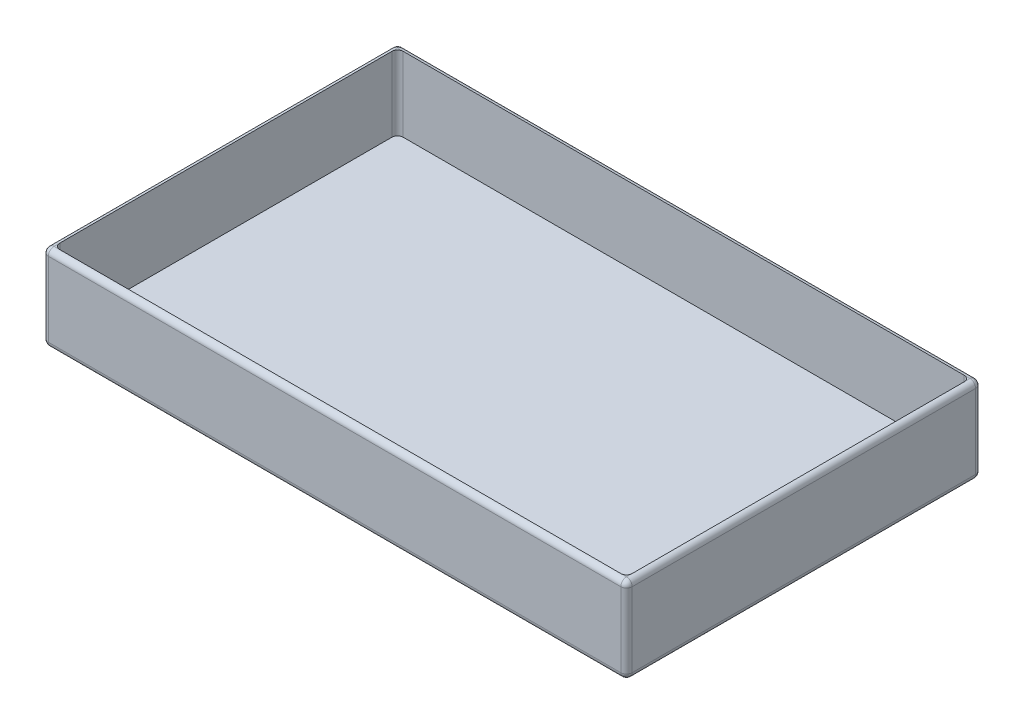
ISO-10303-21;
HEADER;
FILE_DESCRIPTION(('STEP AP214'),'2;1');
FILE_NAME('part.step','',(''),(''),'','','');
FILE_SCHEMA(('AUTOMOTIVE_DESIGN { 1 0 10303 214 1 1 1 1 }'));
ENDSEC;
DATA;
#1=APPLICATION_CONTEXT('core data for automotive mechanical design processes');
#2=APPLICATION_PROTOCOL_DEFINITION('international standard','automotive_design',2000,#1);
#3=PRODUCT_CONTEXT('',#1,'mechanical');
#4=PRODUCT('Part','Part','',(#3));
#5=PRODUCT_RELATED_PRODUCT_CATEGORY('part','',(#4));
#6=PRODUCT_DEFINITION_FORMATION('','',#4);
#7=PRODUCT_DEFINITION_CONTEXT('part definition',#1,'design');
#8=PRODUCT_DEFINITION('design','',#6,#7);
#9=PRODUCT_DEFINITION_SHAPE('','',#8);
#10=(LENGTH_UNIT() NAMED_UNIT(*) SI_UNIT(.MILLI.,.METRE.));
#11=(NAMED_UNIT(*) PLANE_ANGLE_UNIT() SI_UNIT($,.RADIAN.));
#12=(NAMED_UNIT(*) SI_UNIT($,.STERADIAN.) SOLID_ANGLE_UNIT());
#13=UNCERTAINTY_MEASURE_WITH_UNIT(LENGTH_MEASURE(1.E-05),#10,'distance_accuracy_value','');
#14=(GEOMETRIC_REPRESENTATION_CONTEXT(3) GLOBAL_UNCERTAINTY_ASSIGNED_CONTEXT((#13)) GLOBAL_UNIT_ASSIGNED_CONTEXT((#10,
#11,#12)) REPRESENTATION_CONTEXT('',''));
#15=CARTESIAN_POINT('',(0.,0.,0.));
#16=DIRECTION('',(0.,0.,1.));
#17=DIRECTION('',(1.,0.,0.));
#18=AXIS2_PLACEMENT_3D('',#15,#16,#17);
#19=CARTESIAN_POINT('',(0.,15.,0.));
#20=DIRECTION('',(0.,1.,0.));
#21=DIRECTION('',(0.,0.,1.));
#22=AXIS2_PLACEMENT_3D('',#19,#20,#21);
#23=PLANE('',#22);
#24=DIRECTION('',(1.,0.,0.));
#25=VECTOR('',#24,1.);
#26=CARTESIAN_POINT('',(51.,15.,30.));
#27=LINE('',#26,#25);
#28=CARTESIAN_POINT('',(49.,15.,30.));
#29=VERTEX_POINT('',#28);
#30=CARTESIAN_POINT('',(50.,15.,30.));
#31=VERTEX_POINT('',#30);
#32=EDGE_CURVE('E255',#29,#31,#27,.T.);
#33=ORIENTED_EDGE('',*,*,#32,.T.);
#34=DIRECTION('',(0.,0.,-1.));
#35=VECTOR('',#34,1.);
#36=CARTESIAN_POINT('',(50.,15.,-31.));
#37=LINE('',#36,#35);
#38=CARTESIAN_POINT('',(50.,15.,29.));
#39=VERTEX_POINT('',#38);
#40=EDGE_CURVE('E257',#31,#39,#37,.T.);
#41=ORIENTED_EDGE('',*,*,#40,.T.);
#42=CARTESIAN_POINT('',(49.,15.,29.));
#43=DIRECTION('',(0.,1.,0.));
#44=DIRECTION('',(0.,0.,1.));
#45=AXIS2_PLACEMENT_3D('',#42,#43,#44);
#46=CIRCLE('',#45,1.);
#47=EDGE_CURVE('E246',#39,#29,#46,.F.);
#48=ORIENTED_EDGE('',*,*,#47,.T.);
#49=EDGE_LOOP('',(#33,#41,#48));
#50=FACE_BOUND('',#49,.T.);
#51=ADVANCED_FACE('F35',(#50),#23,.T.);
#52=DIRECTION('',(0.,0.,1.));
#53=VECTOR('',#52,1.);
#54=CARTESIAN_POINT('',(-50.,15.,31.));
#55=LINE('',#54,#53);
#56=CARTESIAN_POINT('',(-50.,15.,29.));
#57=VERTEX_POINT('',#56);
#58=CARTESIAN_POINT('',(-50.,15.,30.));
#59=VERTEX_POINT('',#58);
#60=EDGE_CURVE('E251',#57,#59,#55,.T.);
#61=ORIENTED_EDGE('',*,*,#60,.T.);
#62=DIRECTION('',(1.,0.,0.));
#63=VECTOR('',#62,1.);
#64=CARTESIAN_POINT('',(51.,15.,30.));
#65=LINE('',#64,#63);
#66=CARTESIAN_POINT('',(-49.,15.,30.));
#67=VERTEX_POINT('',#66);
#68=EDGE_CURVE('E253',#59,#67,#65,.T.);
#69=ORIENTED_EDGE('',*,*,#68,.T.);
#70=CARTESIAN_POINT('',(-49.,15.,29.));
#71=DIRECTION('',(0.,1.,0.));
#72=DIRECTION('',(0.,0.,1.));
#73=AXIS2_PLACEMENT_3D('',#70,#71,#72);
#74=CIRCLE('',#73,1.);
#75=EDGE_CURVE('E244',#67,#57,#74,.F.);
#76=ORIENTED_EDGE('',*,*,#75,.T.);
#77=EDGE_LOOP('',(#61,#69,#76));
#78=FACE_BOUND('',#77,.T.);
#79=ADVANCED_FACE('F446',(#78),#23,.T.);
#80=CARTESIAN_POINT('',(49.,15.,-29.));
#81=DIRECTION('',(0.,1.,0.));
#82=DIRECTION('',(0.,0.,1.));
#83=AXIS2_PLACEMENT_3D('',#80,#81,#82);
#84=CIRCLE('',#83,1.);
#85=CARTESIAN_POINT('',(49.,15.,-30.));
#86=VERTEX_POINT('',#85);
#87=CARTESIAN_POINT('',(50.,15.,-29.));
#88=VERTEX_POINT('',#87);
#89=EDGE_CURVE('E173',#86,#88,#84,.F.);
#90=ORIENTED_EDGE('',*,*,#89,.T.);
#91=DIRECTION('',(0.,0.,-1.));
#92=VECTOR('',#91,1.);
#93=CARTESIAN_POINT('',(50.,15.,-31.));
#94=LINE('',#93,#92);
#95=CARTESIAN_POINT('',(50.,15.,-30.));
#96=VERTEX_POINT('',#95);
#97=EDGE_CURVE('E176',#88,#96,#94,.T.);
#98=ORIENTED_EDGE('',*,*,#97,.T.);
#99=DIRECTION('',(-1.,0.,0.));
#100=VECTOR('',#99,1.);
#101=CARTESIAN_POINT('',(-51.,15.,-30.));
#102=LINE('',#101,#100);
#103=EDGE_CURVE('E170',#96,#86,#102,.T.);
#104=ORIENTED_EDGE('',*,*,#103,.T.);
#105=EDGE_LOOP('',(#90,#98,#104));
#106=FACE_BOUND('',#105,.T.);
#107=ADVANCED_FACE('F172',(#106),#23,.T.);
#108=CARTESIAN_POINT('',(51.,15.,-31.));
#109=DIRECTION('',(-1.,0.,0.));
#110=DIRECTION('',(0.,0.,1.));
#111=AXIS2_PLACEMENT_3D('',#108,#109,#110);
#112=PLANE('',#111);
#113=DIRECTION('',(0.,-1.,0.));
#114=VECTOR('',#113,1.);
#115=CARTESIAN_POINT('',(51.,15.,-30.));
#116=LINE('',#115,#114);
#117=CARTESIAN_POINT('',(51.,1.,-30.));
#118=VERTEX_POINT('',#117);
#119=CARTESIAN_POINT('',(51.,14.,-30.));
#120=VERTEX_POINT('',#119);
#121=EDGE_CURVE('E262',#118,#120,#116,.F.);
#122=ORIENTED_EDGE('',*,*,#121,.T.);
#123=DIRECTION('',(0.,0.,-1.));
#124=VECTOR('',#123,1.);
#125=CARTESIAN_POINT('',(51.,14.,31.));
#126=LINE('',#125,#124);
#127=CARTESIAN_POINT('',(51.,14.,30.));
#128=VERTEX_POINT('',#127);
#129=EDGE_CURVE('E266',#120,#128,#126,.F.);
#130=ORIENTED_EDGE('',*,*,#129,.T.);
#131=DIRECTION('',(0.,-1.,0.));
#132=VECTOR('',#131,1.);
#133=CARTESIAN_POINT('',(51.,15.,30.));
#134=LINE('',#133,#132);
#135=CARTESIAN_POINT('',(51.,1.,30.));
#136=VERTEX_POINT('',#135);
#137=EDGE_CURVE('E264',#128,#136,#134,.T.);
#138=ORIENTED_EDGE('',*,*,#137,.T.);
#139=DIRECTION('',(0.,0.,-1.));
#140=VECTOR('',#139,1.);
#141=CARTESIAN_POINT('',(51.,1.,-31.));
#142=LINE('',#141,#140);
#143=EDGE_CURVE('E260',#136,#118,#142,.T.);
#144=ORIENTED_EDGE('',*,*,#143,.T.);
#145=EDGE_LOOP('',(#122,#130,#138,#144));
#146=FACE_BOUND('',#145,.T.);
#147=ADVANCED_FACE('F465',(#146),#112,.F.);
#148=CARTESIAN_POINT('',(-51.,15.,-31.));
#149=DIRECTION('',(0.,0.,1.));
#150=DIRECTION('',(1.,0.,0.));
#151=AXIS2_PLACEMENT_3D('',#148,#149,#150);
#152=PLANE('',#151);
#153=DIRECTION('',(-1.,0.,0.));
#154=VECTOR('',#153,1.);
#155=CARTESIAN_POINT('',(51.,14.,-31.));
#156=LINE('',#155,#154);
#157=CARTESIAN_POINT('',(-50.,14.,-31.));
#158=VERTEX_POINT('',#157);
#159=CARTESIAN_POINT('',(50.,14.,-31.));
#160=VERTEX_POINT('',#159);
#161=EDGE_CURVE('E291',#158,#160,#156,.F.);
#162=ORIENTED_EDGE('',*,*,#161,.T.);
#163=DIRECTION('',(0.,-1.,0.));
#164=VECTOR('',#163,1.);
#165=CARTESIAN_POINT('',(50.,15.,-31.));
#166=LINE('',#165,#164);
#167=CARTESIAN_POINT('',(50.,1.,-31.));
#168=VERTEX_POINT('',#167);
#169=EDGE_CURVE('E293',#160,#168,#166,.T.);
#170=ORIENTED_EDGE('',*,*,#169,.T.);
#171=DIRECTION('',(-1.,0.,0.));
#172=VECTOR('',#171,1.);
#173=CARTESIAN_POINT('',(-51.,1.,-31.));
#174=LINE('',#173,#172);
#175=CARTESIAN_POINT('',(-50.,1.,-31.));
#176=VERTEX_POINT('',#175);
#177=EDGE_CURVE('E287',#168,#176,#174,.T.);
#178=ORIENTED_EDGE('',*,*,#177,.T.);
#179=DIRECTION('',(0.,-1.,0.));
#180=VECTOR('',#179,1.);
#181=CARTESIAN_POINT('',(-50.,15.,-31.));
#182=LINE('',#181,#180);
#183=EDGE_CURVE('E289',#176,#158,#182,.F.);
#184=ORIENTED_EDGE('',*,*,#183,.T.);
#185=EDGE_LOOP('',(#162,#170,#178,#184));
#186=FACE_BOUND('',#185,.T.);
#187=ADVANCED_FACE('F469',(#186),#152,.F.);
#188=CARTESIAN_POINT('',(-51.,15.,-31.));
#189=DIRECTION('',(1.,0.,0.));
#190=DIRECTION('',(0.,0.,-1.));
#191=AXIS2_PLACEMENT_3D('',#188,#189,#190);
#192=PLANE('',#191);
#193=DIRECTION('',(0.,-1.,0.));
#194=VECTOR('',#193,1.);
#195=CARTESIAN_POINT('',(-51.,15.,30.));
#196=LINE('',#195,#194);
#197=CARTESIAN_POINT('',(-51.,1.,30.));
#198=VERTEX_POINT('',#197);
#199=CARTESIAN_POINT('',(-51.,14.,30.));
#200=VERTEX_POINT('',#199);
#201=EDGE_CURVE('E282',#198,#200,#196,.F.);
#202=ORIENTED_EDGE('',*,*,#201,.T.);
#203=DIRECTION('',(0.,0.,1.));
#204=VECTOR('',#203,1.);
#205=CARTESIAN_POINT('',(-51.,14.,-31.));
#206=LINE('',#205,#204);
#207=CARTESIAN_POINT('',(-51.,14.,-30.));
#208=VERTEX_POINT('',#207);
#209=EDGE_CURVE('E284',#200,#208,#206,.F.);
#210=ORIENTED_EDGE('',*,*,#209,.T.);
#211=DIRECTION('',(0.,-1.,0.));
#212=VECTOR('',#211,1.);
#213=CARTESIAN_POINT('',(-51.,15.,-30.));
#214=LINE('',#213,#212);
#215=CARTESIAN_POINT('',(-51.,1.,-30.));
#216=VERTEX_POINT('',#215);
#217=EDGE_CURVE('E280',#208,#216,#214,.T.);
#218=ORIENTED_EDGE('',*,*,#217,.T.);
#219=DIRECTION('',(0.,0.,1.));
#220=VECTOR('',#219,1.);
#221=CARTESIAN_POINT('',(-51.,1.,-31.));
#222=LINE('',#221,#220);
#223=EDGE_CURVE('E278',#216,#198,#222,.T.);
#224=ORIENTED_EDGE('',*,*,#223,.T.);
#225=EDGE_LOOP('',(#202,#210,#218,#224));
#226=FACE_BOUND('',#225,.T.);
#227=ADVANCED_FACE('F388',(#226),#192,.F.);
#228=CARTESIAN_POINT('',(-51.,15.,31.));
#229=DIRECTION('',(0.,0.,-1.));
#230=DIRECTION('',(-1.,0.,0.));
#231=AXIS2_PLACEMENT_3D('',#228,#229,#230);
#232=PLANE('',#231);
#233=DIRECTION('',(0.,-1.,0.));
#234=VECTOR('',#233,1.);
#235=CARTESIAN_POINT('',(50.,15.,31.));
#236=LINE('',#235,#234);
#237=CARTESIAN_POINT('',(50.,1.,31.));
#238=VERTEX_POINT('',#237);
#239=CARTESIAN_POINT('',(50.,14.,31.));
#240=VERTEX_POINT('',#239);
#241=EDGE_CURVE('E273',#238,#240,#236,.F.);
#242=ORIENTED_EDGE('',*,*,#241,.T.);
#243=DIRECTION('',(1.,0.,0.));
#244=VECTOR('',#243,1.);
#245=CARTESIAN_POINT('',(-51.,14.,31.));
#246=LINE('',#245,#244);
#247=CARTESIAN_POINT('',(-50.,14.,31.));
#248=VERTEX_POINT('',#247);
#249=EDGE_CURVE('E275',#240,#248,#246,.F.);
#250=ORIENTED_EDGE('',*,*,#249,.T.);
#251=DIRECTION('',(0.,-1.,0.));
#252=VECTOR('',#251,1.);
#253=CARTESIAN_POINT('',(-50.,15.,31.));
#254=LINE('',#253,#252);
#255=CARTESIAN_POINT('',(-50.,1.,31.));
#256=VERTEX_POINT('',#255);
#257=EDGE_CURVE('E271',#248,#256,#254,.T.);
#258=ORIENTED_EDGE('',*,*,#257,.T.);
#259=DIRECTION('',(1.,0.,0.));
#260=VECTOR('',#259,1.);
#261=CARTESIAN_POINT('',(-51.,1.,31.));
#262=LINE('',#261,#260);
#263=EDGE_CURVE('E269',#256,#238,#262,.T.);
#264=ORIENTED_EDGE('',*,*,#263,.T.);
#265=EDGE_LOOP('',(#242,#250,#258,#264));
#266=FACE_BOUND('',#265,.T.);
#267=ADVANCED_FACE('F379',(#266),#232,.F.);
#268=DIRECTION('',(-1.,0.,0.));
#269=VECTOR('',#268,1.);
#270=CARTESIAN_POINT('',(-51.,15.,-30.));
#271=LINE('',#270,#269);
#272=CARTESIAN_POINT('',(-49.,15.,-30.));
#273=VERTEX_POINT('',#272);
#274=CARTESIAN_POINT('',(-50.,15.,-30.));
#275=VERTEX_POINT('',#274);
#276=EDGE_CURVE('E208',#273,#275,#271,.T.);
#277=ORIENTED_EDGE('',*,*,#276,.T.);
#278=DIRECTION('',(0.,0.,1.));
#279=VECTOR('',#278,1.);
#280=CARTESIAN_POINT('',(-50.,15.,31.));
#281=LINE('',#280,#279);
#282=CARTESIAN_POINT('',(-50.,15.,-29.));
#283=VERTEX_POINT('',#282);
#284=EDGE_CURVE('E181',#275,#283,#281,.T.);
#285=ORIENTED_EDGE('',*,*,#284,.T.);
#286=CARTESIAN_POINT('',(-49.,15.,-29.));
#287=DIRECTION('',(0.,1.,0.));
#288=DIRECTION('',(0.,0.,1.));
#289=AXIS2_PLACEMENT_3D('',#286,#287,#288);
#290=CIRCLE('',#289,1.);
#291=EDGE_CURVE('E191',#283,#273,#290,.F.);
#292=ORIENTED_EDGE('',*,*,#291,.T.);
#293=EDGE_LOOP('',(#277,#285,#292));
#294=FACE_BOUND('',#293,.T.);
#295=ADVANCED_FACE('F449',(#294),#23,.T.);
#296=CARTESIAN_POINT('',(0.,0.,0.));
#297=DIRECTION('',(0.,1.,0.));
#298=DIRECTION('',(0.,0.,1.));
#299=AXIS2_PLACEMENT_3D('',#296,#297,#298);
#300=PLANE('',#299);
#301=DIRECTION('',(0.,0.,1.));
#302=VECTOR('',#301,1.);
#303=CARTESIAN_POINT('',(-50.,0.,0.));
#304=LINE('',#303,#302);
#305=CARTESIAN_POINT('',(-50.,0.,30.));
#306=VERTEX_POINT('',#305);
#307=CARTESIAN_POINT('',(-50.,0.,-30.));
#308=VERTEX_POINT('',#307);
#309=EDGE_CURVE('E44',#306,#308,#304,.F.);
#310=ORIENTED_EDGE('',*,*,#309,.T.);
#311=DIRECTION('',(-1.,0.,0.));
#312=VECTOR('',#311,1.);
#313=CARTESIAN_POINT('',(0.,0.,-30.));
#314=LINE('',#313,#312);
#315=CARTESIAN_POINT('',(50.,0.,-30.));
#316=VERTEX_POINT('',#315);
#317=EDGE_CURVE('E11',#308,#316,#314,.F.);
#318=ORIENTED_EDGE('',*,*,#317,.T.);
#319=DIRECTION('',(0.,0.,-1.));
#320=VECTOR('',#319,1.);
#321=CARTESIAN_POINT('',(50.,0.,0.));
#322=LINE('',#321,#320);
#323=CARTESIAN_POINT('',(50.,0.,30.));
#324=VERTEX_POINT('',#323);
#325=EDGE_CURVE('E296',#316,#324,#322,.F.);
#326=ORIENTED_EDGE('',*,*,#325,.T.);
#327=DIRECTION('',(1.,0.,0.));
#328=VECTOR('',#327,1.);
#329=CARTESIAN_POINT('',(0.,0.,30.));
#330=LINE('',#329,#328);
#331=EDGE_CURVE('E55',#324,#306,#330,.F.);
#332=ORIENTED_EDGE('',*,*,#331,.T.);
#333=EDGE_LOOP('',(#310,#318,#326,#332));
#334=FACE_BOUND('',#333,.T.);
#335=ADVANCED_FACE('F411',(#334),#300,.F.);
#336=CARTESIAN_POINT('',(50.,2.,30.));
#337=DIRECTION('',(1.,0.,0.));
#338=DIRECTION('',(0.,0.,-1.));
#339=AXIS2_PLACEMENT_3D('',#336,#337,#338);
#340=PLANE('',#339);
#341=DIRECTION('',(0.,0.,-1.));
#342=VECTOR('',#341,1.);
#343=CARTESIAN_POINT('',(50.,15.,30.));
#344=LINE('',#343,#342);
#345=EDGE_CURVE('E210',#39,#88,#344,.T.);
#346=ORIENTED_EDGE('',*,*,#345,.T.);
#347=DIRECTION('',(0.,1.,0.));
#348=VECTOR('',#347,1.);
#349=CARTESIAN_POINT('',(50.,2.,-29.));
#350=LINE('',#349,#348);
#351=CARTESIAN_POINT('',(50.,2.,-29.));
#352=VERTEX_POINT('',#351);
#353=EDGE_CURVE('E190',#88,#352,#350,.F.);
#354=ORIENTED_EDGE('',*,*,#353,.T.);
#355=DIRECTION('',(0.,0.,-1.));
#356=VECTOR('',#355,1.);
#357=CARTESIAN_POINT('',(50.,2.,30.));
#358=LINE('',#357,#356);
#359=CARTESIAN_POINT('',(50.,2.,29.));
#360=VERTEX_POINT('',#359);
#361=EDGE_CURVE('E220',#360,#352,#358,.T.);
#362=ORIENTED_EDGE('',*,*,#361,.F.);
#363=DIRECTION('',(0.,1.,0.));
#364=VECTOR('',#363,1.);
#365=CARTESIAN_POINT('',(50.,15.,29.));
#366=LINE('',#365,#364);
#367=EDGE_CURVE('E202',#360,#39,#366,.T.);
#368=ORIENTED_EDGE('',*,*,#367,.T.);
#369=EDGE_LOOP('',(#346,#354,#362,#368));
#370=FACE_BOUND('',#369,.T.);
#371=ADVANCED_FACE('F462',(#370),#340,.F.);
#372=CARTESIAN_POINT('',(-50.,2.,30.));
#373=DIRECTION('',(0.,0.,1.));
#374=DIRECTION('',(1.,0.,0.));
#375=AXIS2_PLACEMENT_3D('',#372,#373,#374);
#376=PLANE('',#375);
#377=DIRECTION('',(1.,0.,0.));
#378=VECTOR('',#377,1.);
#379=CARTESIAN_POINT('',(-50.,2.,30.));
#380=LINE('',#379,#378);
#381=CARTESIAN_POINT('',(-49.,2.,30.));
#382=VERTEX_POINT('',#381);
#383=CARTESIAN_POINT('',(49.,2.,30.));
#384=VERTEX_POINT('',#383);
#385=EDGE_CURVE('E221',#382,#384,#380,.T.);
#386=ORIENTED_EDGE('',*,*,#385,.F.);
#387=DIRECTION('',(0.,1.,0.));
#388=VECTOR('',#387,1.);
#389=CARTESIAN_POINT('',(-49.,15.,30.));
#390=LINE('',#389,#388);
#391=EDGE_CURVE('E192',#382,#67,#390,.T.);
#392=ORIENTED_EDGE('',*,*,#391,.T.);
#393=DIRECTION('',(1.,0.,0.));
#394=VECTOR('',#393,1.);
#395=CARTESIAN_POINT('',(-50.,15.,30.));
#396=LINE('',#395,#394);
#397=EDGE_CURVE('E213',#67,#29,#396,.T.);
#398=ORIENTED_EDGE('',*,*,#397,.T.);
#399=DIRECTION('',(0.,1.,0.));
#400=VECTOR('',#399,1.);
#401=CARTESIAN_POINT('',(49.,2.,30.));
#402=LINE('',#401,#400);
#403=EDGE_CURVE('E239',#29,#384,#402,.F.);
#404=ORIENTED_EDGE('',*,*,#403,.T.);
#405=EDGE_LOOP('',(#386,#392,#398,#404));
#406=FACE_BOUND('',#405,.T.);
#407=ADVANCED_FACE('F542',(#406),#376,.F.);
#408=CARTESIAN_POINT('',(-50.,2.,30.));
#409=DIRECTION('',(-1.,0.,0.));
#410=DIRECTION('',(0.,0.,1.));
#411=AXIS2_PLACEMENT_3D('',#408,#409,#410);
#412=PLANE('',#411);
#413=DIRECTION('',(0.,0.,1.));
#414=VECTOR('',#413,1.);
#415=CARTESIAN_POINT('',(-50.,2.,30.));
#416=LINE('',#415,#414);
#417=CARTESIAN_POINT('',(-50.,2.,-29.));
#418=VERTEX_POINT('',#417);
#419=CARTESIAN_POINT('',(-50.,2.,29.));
#420=VERTEX_POINT('',#419);
#421=EDGE_CURVE('E533',#418,#420,#416,.T.);
#422=ORIENTED_EDGE('',*,*,#421,.F.);
#423=DIRECTION('',(0.,1.,0.));
#424=VECTOR('',#423,1.);
#425=CARTESIAN_POINT('',(-50.,15.,-29.));
#426=LINE('',#425,#424);
#427=EDGE_CURVE('E236',#418,#283,#426,.T.);
#428=ORIENTED_EDGE('',*,*,#427,.T.);
#429=DIRECTION('',(0.,0.,1.));
#430=VECTOR('',#429,1.);
#431=CARTESIAN_POINT('',(-50.,15.,30.));
#432=LINE('',#431,#430);
#433=EDGE_CURVE('E209',#283,#57,#432,.T.);
#434=ORIENTED_EDGE('',*,*,#433,.T.);
#435=DIRECTION('',(0.,1.,0.));
#436=VECTOR('',#435,1.);
#437=CARTESIAN_POINT('',(-50.,2.,29.));
#438=LINE('',#437,#436);
#439=EDGE_CURVE('E234',#57,#420,#438,.F.);
#440=ORIENTED_EDGE('',*,*,#439,.T.);
#441=EDGE_LOOP('',(#422,#428,#434,#440));
#442=FACE_BOUND('',#441,.T.);
#443=ADVANCED_FACE('F547',(#442),#412,.F.);
#444=CARTESIAN_POINT('',(-50.,2.,-30.));
#445=DIRECTION('',(0.,0.,-1.));
#446=DIRECTION('',(-1.,0.,0.));
#447=AXIS2_PLACEMENT_3D('',#444,#445,#446);
#448=PLANE('',#447);
#449=DIRECTION('',(-1.,0.,0.));
#450=VECTOR('',#449,1.);
#451=CARTESIAN_POINT('',(-50.,2.,-30.));
#452=LINE('',#451,#450);
#453=CARTESIAN_POINT('',(49.,2.,-30.));
#454=VERTEX_POINT('',#453);
#455=CARTESIAN_POINT('',(-49.,2.,-30.));
#456=VERTEX_POINT('',#455);
#457=EDGE_CURVE('E201',#454,#456,#452,.T.);
#458=ORIENTED_EDGE('',*,*,#457,.F.);
#459=DIRECTION('',(0.,1.,0.));
#460=VECTOR('',#459,1.);
#461=CARTESIAN_POINT('',(49.,15.,-30.));
#462=LINE('',#461,#460);
#463=EDGE_CURVE('E189',#454,#86,#462,.T.);
#464=ORIENTED_EDGE('',*,*,#463,.T.);
#465=DIRECTION('',(-1.,0.,0.));
#466=VECTOR('',#465,1.);
#467=CARTESIAN_POINT('',(-50.,15.,-30.));
#468=LINE('',#467,#466);
#469=EDGE_CURVE('E198',#86,#273,#468,.T.);
#470=ORIENTED_EDGE('',*,*,#469,.T.);
#471=DIRECTION('',(0.,1.,0.));
#472=VECTOR('',#471,1.);
#473=CARTESIAN_POINT('',(-49.,2.,-30.));
#474=LINE('',#473,#472);
#475=EDGE_CURVE('E203',#273,#456,#474,.F.);
#476=ORIENTED_EDGE('',*,*,#475,.T.);
#477=EDGE_LOOP('',(#458,#464,#470,#476));
#478=FACE_BOUND('',#477,.T.);
#479=ADVANCED_FACE('F197',(#478),#448,.F.);
#480=CARTESIAN_POINT('',(0.,2.,0.));
#481=DIRECTION('',(0.,-1.,0.));
#482=DIRECTION('',(0.,0.,-1.));
#483=AXIS2_PLACEMENT_3D('',#480,#481,#482);
#484=PLANE('',#483);
#485=ORIENTED_EDGE('',*,*,#361,.T.);
#486=CARTESIAN_POINT('',(49.,2.,-29.));
#487=DIRECTION('',(0.,-1.,0.));
#488=DIRECTION('',(0.,0.,-1.));
#489=AXIS2_PLACEMENT_3D('',#486,#487,#488);
#490=CIRCLE('',#489,1.);
#491=EDGE_CURVE('E232',#352,#454,#490,.F.);
#492=ORIENTED_EDGE('',*,*,#491,.T.);
#493=ORIENTED_EDGE('',*,*,#457,.T.);
#494=CARTESIAN_POINT('',(-49.,2.,-29.));
#495=DIRECTION('',(0.,-1.,0.));
#496=DIRECTION('',(0.,0.,-1.));
#497=AXIS2_PLACEMENT_3D('',#494,#495,#496);
#498=CIRCLE('',#497,1.);
#499=EDGE_CURVE('E230',#456,#418,#498,.F.);
#500=ORIENTED_EDGE('',*,*,#499,.T.);
#501=ORIENTED_EDGE('',*,*,#421,.T.);
#502=CARTESIAN_POINT('',(-49.,2.,29.));
#503=DIRECTION('',(0.,-1.,0.));
#504=DIRECTION('',(0.,0.,-1.));
#505=AXIS2_PLACEMENT_3D('',#502,#503,#504);
#506=CIRCLE('',#505,1.);
#507=EDGE_CURVE('E228',#420,#382,#506,.F.);
#508=ORIENTED_EDGE('',*,*,#507,.T.);
#509=ORIENTED_EDGE('',*,*,#385,.T.);
#510=CARTESIAN_POINT('',(49.,2.,29.));
#511=DIRECTION('',(0.,-1.,0.));
#512=DIRECTION('',(0.,0.,-1.));
#513=AXIS2_PLACEMENT_3D('',#510,#511,#512);
#514=CIRCLE('',#513,1.);
#515=EDGE_CURVE('E226',#384,#360,#514,.F.);
#516=ORIENTED_EDGE('',*,*,#515,.T.);
#517=EDGE_LOOP('',(#485,#492,#493,#500,#501,#508,#509,#516));
#518=FACE_BOUND('',#517,.T.);
#519=ADVANCED_FACE('F482',(#518),#484,.F.);
#520=CARTESIAN_POINT('',(49.,2.,-29.));
#521=DIRECTION('',(0.,-1.,0.));
#522=DIRECTION('',(0.,0.,-1.));
#523=AXIS2_PLACEMENT_3D('',#520,#521,#522);
#524=CYLINDRICAL_SURFACE('',#523,1.);
#525=ORIENTED_EDGE('',*,*,#491,.F.);
#526=ORIENTED_EDGE('',*,*,#353,.F.);
#527=ORIENTED_EDGE('',*,*,#89,.F.);
#528=ORIENTED_EDGE('',*,*,#463,.F.);
#529=EDGE_LOOP('',(#525,#526,#527,#528));
#530=FACE_BOUND('',#529,.T.);
#531=ADVANCED_FACE('F188',(#530),#524,.F.);
#532=CARTESIAN_POINT('',(-49.,2.,-29.));
#533=DIRECTION('',(0.,-1.,0.));
#534=DIRECTION('',(0.,0.,-1.));
#535=AXIS2_PLACEMENT_3D('',#532,#533,#534);
#536=CYLINDRICAL_SURFACE('',#535,1.);
#537=ORIENTED_EDGE('',*,*,#499,.F.);
#538=ORIENTED_EDGE('',*,*,#475,.F.);
#539=ORIENTED_EDGE('',*,*,#291,.F.);
#540=ORIENTED_EDGE('',*,*,#427,.F.);
#541=EDGE_LOOP('',(#537,#538,#539,#540));
#542=FACE_BOUND('',#541,.T.);
#543=ADVANCED_FACE('F481',(#542),#536,.F.);
#544=CARTESIAN_POINT('',(-49.,2.,29.));
#545=DIRECTION('',(0.,-1.,0.));
#546=DIRECTION('',(0.,0.,-1.));
#547=AXIS2_PLACEMENT_3D('',#544,#545,#546);
#548=CYLINDRICAL_SURFACE('',#547,1.);
#549=ORIENTED_EDGE('',*,*,#507,.F.);
#550=ORIENTED_EDGE('',*,*,#439,.F.);
#551=ORIENTED_EDGE('',*,*,#75,.F.);
#552=ORIENTED_EDGE('',*,*,#391,.F.);
#553=EDGE_LOOP('',(#549,#550,#551,#552));
#554=FACE_BOUND('',#553,.T.);
#555=ADVANCED_FACE('F485',(#554),#548,.F.);
#556=CARTESIAN_POINT('',(49.,2.,29.));
#557=DIRECTION('',(0.,-1.,0.));
#558=DIRECTION('',(0.,0.,-1.));
#559=AXIS2_PLACEMENT_3D('',#556,#557,#558);
#560=CYLINDRICAL_SURFACE('',#559,1.);
#561=ORIENTED_EDGE('',*,*,#515,.F.);
#562=ORIENTED_EDGE('',*,*,#403,.F.);
#563=ORIENTED_EDGE('',*,*,#47,.F.);
#564=ORIENTED_EDGE('',*,*,#367,.F.);
#565=EDGE_LOOP('',(#561,#562,#563,#564));
#566=FACE_BOUND('',#565,.T.);
#567=ADVANCED_FACE('F489',(#566),#560,.F.);
#568=CARTESIAN_POINT('',(-50.,1.,-31.));
#569=DIRECTION('',(0.,0.,1.));
#570=DIRECTION('',(1.,0.,0.));
#571=AXIS2_PLACEMENT_3D('',#568,#569,#570);
#572=CYLINDRICAL_SURFACE('',#571,1.);
#573=CARTESIAN_POINT('',(-50.,1.,30.));
#574=DIRECTION('',(0.,0.,1.));
#575=DIRECTION('',(1.,0.,0.));
#576=AXIS2_PLACEMENT_3D('',#573,#574,#575);
#577=CIRCLE('',#576,1.);
#578=EDGE_CURVE('E39',#198,#306,#577,.T.);
#579=ORIENTED_EDGE('',*,*,#578,.F.);
#580=ORIENTED_EDGE('',*,*,#223,.F.);
#581=CARTESIAN_POINT('',(-50.,1.,-30.));
#582=DIRECTION('',(0.,0.,-1.));
#583=DIRECTION('',(-1.,0.,0.));
#584=AXIS2_PLACEMENT_3D('',#581,#582,#583);
#585=CIRCLE('',#584,1.);
#586=EDGE_CURVE('E358',#308,#216,#585,.T.);
#587=ORIENTED_EDGE('',*,*,#586,.F.);
#588=ORIENTED_EDGE('',*,*,#309,.F.);
#589=EDGE_LOOP('',(#579,#580,#587,#588));
#590=FACE_BOUND('',#589,.T.);
#591=ADVANCED_FACE('F37',(#590),#572,.T.);
#592=CARTESIAN_POINT('',(-50.,1.,30.));
#593=DIRECTION('',(0.,0.,1.));
#594=DIRECTION('',(1.,0.,0.));
#595=AXIS2_PLACEMENT_3D('',#592,#593,#594);
#596=SPHERICAL_SURFACE('',#595,1.);
#597=CARTESIAN_POINT('',(-50.,1.,30.));
#598=DIRECTION('',(0.,-1.,0.));
#599=DIRECTION('',(0.,0.,-1.));
#600=AXIS2_PLACEMENT_3D('',#597,#598,#599);
#601=CIRCLE('',#600,1.);
#602=EDGE_CURVE('E353',#198,#256,#601,.F.);
#603=ORIENTED_EDGE('',*,*,#602,.F.);
#604=ORIENTED_EDGE('',*,*,#578,.T.);
#605=CARTESIAN_POINT('',(-50.,1.,30.));
#606=DIRECTION('',(-1.,0.,0.));
#607=DIRECTION('',(0.,0.,1.));
#608=AXIS2_PLACEMENT_3D('',#605,#606,#607);
#609=CIRCLE('',#608,1.);
#610=EDGE_CURVE('E356',#256,#306,#609,.F.);
#611=ORIENTED_EDGE('',*,*,#610,.F.);
#612=EDGE_LOOP('',(#603,#604,#611));
#613=FACE_BOUND('',#612,.T.);
#614=ADVANCED_FACE('F368',(#613),#596,.T.);
#615=CARTESIAN_POINT('',(-50.,1.,-30.));
#616=DIRECTION('',(0.,0.,1.));
#617=DIRECTION('',(1.,0.,0.));
#618=AXIS2_PLACEMENT_3D('',#615,#616,#617);
#619=SPHERICAL_SURFACE('',#618,1.);
#620=CARTESIAN_POINT('',(-50.,1.,-30.));
#621=DIRECTION('',(-1.,0.,0.));
#622=DIRECTION('',(0.,0.,1.));
#623=AXIS2_PLACEMENT_3D('',#620,#621,#622);
#624=CIRCLE('',#623,1.);
#625=EDGE_CURVE('E347',#308,#176,#624,.F.);
#626=ORIENTED_EDGE('',*,*,#625,.F.);
#627=ORIENTED_EDGE('',*,*,#586,.T.);
#628=CARTESIAN_POINT('',(-50.,1.,-30.));
#629=DIRECTION('',(0.,-1.,0.));
#630=DIRECTION('',(0.,0.,-1.));
#631=AXIS2_PLACEMENT_3D('',#628,#629,#630);
#632=CIRCLE('',#631,1.);
#633=EDGE_CURVE('E350',#176,#216,#632,.F.);
#634=ORIENTED_EDGE('',*,*,#633,.F.);
#635=EDGE_LOOP('',(#626,#627,#634));
#636=FACE_BOUND('',#635,.T.);
#637=ADVANCED_FACE('F405',(#636),#619,.T.);
#638=CARTESIAN_POINT('',(-51.,1.,30.));
#639=DIRECTION('',(1.,0.,0.));
#640=DIRECTION('',(0.,0.,-1.));
#641=AXIS2_PLACEMENT_3D('',#638,#639,#640);
#642=CYLINDRICAL_SURFACE('',#641,1.);
#643=ORIENTED_EDGE('',*,*,#610,.T.);
#644=ORIENTED_EDGE('',*,*,#331,.F.);
#645=CARTESIAN_POINT('',(50.,1.,30.));
#646=DIRECTION('',(1.,0.,0.));
#647=DIRECTION('',(0.,0.,-1.));
#648=AXIS2_PLACEMENT_3D('',#645,#646,#647);
#649=CIRCLE('',#648,1.);
#650=EDGE_CURVE('E341',#238,#324,#649,.T.);
#651=ORIENTED_EDGE('',*,*,#650,.F.);
#652=ORIENTED_EDGE('',*,*,#263,.F.);
#653=EDGE_LOOP('',(#643,#644,#651,#652));
#654=FACE_BOUND('',#653,.T.);
#655=ADVANCED_FACE('F374',(#654),#642,.T.);
#656=CARTESIAN_POINT('',(-50.,15.,30.));
#657=DIRECTION('',(0.,-1.,0.));
#658=DIRECTION('',(0.,0.,-1.));
#659=AXIS2_PLACEMENT_3D('',#656,#657,#658);
#660=CYLINDRICAL_SURFACE('',#659,1.);
#661=ORIENTED_EDGE('',*,*,#602,.T.);
#662=ORIENTED_EDGE('',*,*,#257,.F.);
#663=CARTESIAN_POINT('',(-50.,14.,30.));
#664=DIRECTION('',(0.,1.,0.));
#665=DIRECTION('',(0.,0.,1.));
#666=AXIS2_PLACEMENT_3D('',#663,#664,#665);
#667=CIRCLE('',#666,1.);
#668=EDGE_CURVE('E338',#200,#248,#667,.T.);
#669=ORIENTED_EDGE('',*,*,#668,.F.);
#670=ORIENTED_EDGE('',*,*,#201,.F.);
#671=EDGE_LOOP('',(#661,#662,#669,#670));
#672=FACE_BOUND('',#671,.T.);
#673=ADVANCED_FACE('F385',(#672),#660,.T.);
#674=CARTESIAN_POINT('',(-50.,14.,0.));
#675=DIRECTION('',(0.,0.,-1.));
#676=DIRECTION('',(-1.,0.,0.));
#677=AXIS2_PLACEMENT_3D('',#674,#675,#676);
#678=CYLINDRICAL_SURFACE('',#677,1.);
#679=CARTESIAN_POINT('',(-50.,14.,-30.));
#680=DIRECTION('',(0.,0.,-1.));
#681=DIRECTION('',(-1.,0.,0.));
#682=AXIS2_PLACEMENT_3D('',#679,#680,#681);
#683=CIRCLE('',#682,1.);
#684=EDGE_CURVE('E332',#208,#275,#683,.T.);
#685=ORIENTED_EDGE('',*,*,#684,.F.);
#686=ORIENTED_EDGE('',*,*,#209,.F.);
#687=CARTESIAN_POINT('',(-50.,14.,30.));
#688=DIRECTION('',(0.,0.,1.));
#689=DIRECTION('',(1.,0.,0.));
#690=AXIS2_PLACEMENT_3D('',#687,#688,#689);
#691=CIRCLE('',#690,1.);
#692=EDGE_CURVE('E335',#59,#200,#691,.T.);
#693=ORIENTED_EDGE('',*,*,#692,.F.);
#694=ORIENTED_EDGE('',*,*,#60,.F.);
#695=ORIENTED_EDGE('',*,*,#433,.F.);
#696=ORIENTED_EDGE('',*,*,#284,.F.);
#697=EDGE_LOOP('',(#685,#686,#693,#694,#695,#696));
#698=FACE_BOUND('',#697,.T.);
#699=ADVANCED_FACE('F392',(#698),#678,.T.);
#700=CARTESIAN_POINT('',(-50.,15.,-30.));
#701=DIRECTION('',(0.,-1.,0.));
#702=DIRECTION('',(0.,0.,-1.));
#703=AXIS2_PLACEMENT_3D('',#700,#701,#702);
#704=CYLINDRICAL_SURFACE('',#703,1.);
#705=ORIENTED_EDGE('',*,*,#633,.T.);
#706=ORIENTED_EDGE('',*,*,#217,.F.);
#707=CARTESIAN_POINT('',(-50.,14.,-30.));
#708=DIRECTION('',(0.,1.,0.));
#709=DIRECTION('',(0.,0.,1.));
#710=AXIS2_PLACEMENT_3D('',#707,#708,#709);
#711=CIRCLE('',#710,1.);
#712=EDGE_CURVE('E330',#158,#208,#711,.T.);
#713=ORIENTED_EDGE('',*,*,#712,.F.);
#714=ORIENTED_EDGE('',*,*,#183,.F.);
#715=EDGE_LOOP('',(#705,#706,#713,#714));
#716=FACE_BOUND('',#715,.T.);
#717=ADVANCED_FACE('F402',(#716),#704,.T.);
#718=CARTESIAN_POINT('',(-51.,1.,-30.));
#719=DIRECTION('',(-1.,0.,0.));
#720=DIRECTION('',(0.,0.,1.));
#721=AXIS2_PLACEMENT_3D('',#718,#719,#720);
#722=CYLINDRICAL_SURFACE('',#721,1.);
#723=ORIENTED_EDGE('',*,*,#625,.T.);
#724=ORIENTED_EDGE('',*,*,#177,.F.);
#725=CARTESIAN_POINT('',(50.,1.,-30.));
#726=DIRECTION('',(1.,0.,0.));
#727=DIRECTION('',(0.,0.,-1.));
#728=AXIS2_PLACEMENT_3D('',#725,#726,#727);
#729=CIRCLE('',#728,1.);
#730=EDGE_CURVE('E327',#316,#168,#729,.T.);
#731=ORIENTED_EDGE('',*,*,#730,.F.);
#732=ORIENTED_EDGE('',*,*,#317,.F.);
#733=EDGE_LOOP('',(#723,#724,#731,#732));
#734=FACE_BOUND('',#733,.T.);
#735=ADVANCED_FACE('F409',(#734),#722,.T.);
#736=CARTESIAN_POINT('',(50.,1.,-31.));
#737=DIRECTION('',(0.,0.,-1.));
#738=DIRECTION('',(-1.,0.,0.));
#739=AXIS2_PLACEMENT_3D('',#736,#737,#738);
#740=CYLINDRICAL_SURFACE('',#739,1.);
#741=CARTESIAN_POINT('',(50.,1.,30.));
#742=DIRECTION('',(0.,0.,1.));
#743=DIRECTION('',(1.,0.,0.));
#744=AXIS2_PLACEMENT_3D('',#741,#742,#743);
#745=CIRCLE('',#744,1.);
#746=EDGE_CURVE('E344',#324,#136,#745,.T.);
#747=ORIENTED_EDGE('',*,*,#746,.F.);
#748=ORIENTED_EDGE('',*,*,#325,.F.);
#749=CARTESIAN_POINT('',(50.,1.,-30.));
#750=DIRECTION('',(0.,0.,-1.));
#751=DIRECTION('',(-1.,0.,0.));
#752=AXIS2_PLACEMENT_3D('',#749,#750,#751);
#753=CIRCLE('',#752,1.);
#754=EDGE_CURVE('E325',#118,#316,#753,.T.);
#755=ORIENTED_EDGE('',*,*,#754,.F.);
#756=ORIENTED_EDGE('',*,*,#143,.F.);
#757=EDGE_LOOP('',(#747,#748,#755,#756));
#758=FACE_BOUND('',#757,.T.);
#759=ADVANCED_FACE('F414',(#758),#740,.T.);
#760=CARTESIAN_POINT('',(50.,1.,30.));
#761=DIRECTION('',(0.,0.,1.));
#762=DIRECTION('',(1.,0.,0.));
#763=AXIS2_PLACEMENT_3D('',#760,#761,#762);
#764=SPHERICAL_SURFACE('',#763,1.);
#765=ORIENTED_EDGE('',*,*,#650,.T.);
#766=ORIENTED_EDGE('',*,*,#746,.T.);
#767=CARTESIAN_POINT('',(50.,1.,30.));
#768=DIRECTION('',(0.,-1.,0.));
#769=DIRECTION('',(0.,0.,-1.));
#770=AXIS2_PLACEMENT_3D('',#767,#768,#769);
#771=CIRCLE('',#770,1.);
#772=EDGE_CURVE('E322',#238,#136,#771,.F.);
#773=ORIENTED_EDGE('',*,*,#772,.F.);
#774=EDGE_LOOP('',(#765,#766,#773));
#775=FACE_BOUND('',#774,.T.);
#776=ADVANCED_FACE('F418',(#775),#764,.T.);
#777=CARTESIAN_POINT('',(-50.,14.,30.));
#778=DIRECTION('',(0.,0.,1.));
#779=DIRECTION('',(1.,0.,0.));
#780=AXIS2_PLACEMENT_3D('',#777,#778,#779);
#781=SPHERICAL_SURFACE('',#780,1.);
#782=ORIENTED_EDGE('',*,*,#692,.T.);
#783=ORIENTED_EDGE('',*,*,#668,.T.);
#784=CARTESIAN_POINT('',(-50.,14.,30.));
#785=DIRECTION('',(-1.,0.,0.));
#786=DIRECTION('',(0.,0.,1.));
#787=AXIS2_PLACEMENT_3D('',#784,#785,#786);
#788=CIRCLE('',#787,1.);
#789=EDGE_CURVE('E320',#59,#248,#788,.F.);
#790=ORIENTED_EDGE('',*,*,#789,.F.);
#791=EDGE_LOOP('',(#782,#783,#790));
#792=FACE_BOUND('',#791,.T.);
#793=ADVANCED_FACE('F434',(#792),#781,.T.);
#794=CARTESIAN_POINT('',(-50.,14.,-30.));
#795=DIRECTION('',(0.,0.,1.));
#796=DIRECTION('',(1.,0.,0.));
#797=AXIS2_PLACEMENT_3D('',#794,#795,#796);
#798=SPHERICAL_SURFACE('',#797,1.);
#799=ORIENTED_EDGE('',*,*,#712,.T.);
#800=ORIENTED_EDGE('',*,*,#684,.T.);
#801=CARTESIAN_POINT('',(-50.,14.,-30.));
#802=DIRECTION('',(-1.,0.,0.));
#803=DIRECTION('',(0.,0.,1.));
#804=AXIS2_PLACEMENT_3D('',#801,#802,#803);
#805=CIRCLE('',#804,1.);
#806=EDGE_CURVE('E318',#158,#275,#805,.F.);
#807=ORIENTED_EDGE('',*,*,#806,.F.);
#808=EDGE_LOOP('',(#799,#800,#807));
#809=FACE_BOUND('',#808,.T.);
#810=ADVANCED_FACE('F436',(#809),#798,.T.);
#811=CARTESIAN_POINT('',(50.,1.,-30.));
#812=DIRECTION('',(0.,0.,1.));
#813=DIRECTION('',(1.,0.,0.));
#814=AXIS2_PLACEMENT_3D('',#811,#812,#813);
#815=SPHERICAL_SURFACE('',#814,1.);
#816=ORIENTED_EDGE('',*,*,#754,.T.);
#817=ORIENTED_EDGE('',*,*,#730,.T.);
#818=CARTESIAN_POINT('',(50.,1.,-30.));
#819=DIRECTION('',(0.,-1.,0.));
#820=DIRECTION('',(0.,0.,-1.));
#821=AXIS2_PLACEMENT_3D('',#818,#819,#820);
#822=CIRCLE('',#821,1.);
#823=EDGE_CURVE('E316',#118,#168,#822,.F.);
#824=ORIENTED_EDGE('',*,*,#823,.F.);
#825=EDGE_LOOP('',(#816,#817,#824));
#826=FACE_BOUND('',#825,.T.);
#827=ADVANCED_FACE('F442',(#826),#815,.T.);
#828=CARTESIAN_POINT('',(50.,15.,30.));
#829=DIRECTION('',(0.,-1.,0.));
#830=DIRECTION('',(0.,0.,-1.));
#831=AXIS2_PLACEMENT_3D('',#828,#829,#830);
#832=CYLINDRICAL_SURFACE('',#831,1.);
#833=ORIENTED_EDGE('',*,*,#772,.T.);
#834=ORIENTED_EDGE('',*,*,#137,.F.);
#835=CARTESIAN_POINT('',(50.,14.,30.));
#836=DIRECTION('',(0.,1.,0.));
#837=DIRECTION('',(0.,0.,1.));
#838=AXIS2_PLACEMENT_3D('',#835,#836,#837);
#839=CIRCLE('',#838,1.);
#840=EDGE_CURVE('E313',#240,#128,#839,.T.);
#841=ORIENTED_EDGE('',*,*,#840,.F.);
#842=ORIENTED_EDGE('',*,*,#241,.F.);
#843=EDGE_LOOP('',(#833,#834,#841,#842));
#844=FACE_BOUND('',#843,.T.);
#845=ADVANCED_FACE('F422',(#844),#832,.T.);
#846=CARTESIAN_POINT('',(0.,14.,30.));
#847=DIRECTION('',(-1.,0.,0.));
#848=DIRECTION('',(0.,0.,1.));
#849=AXIS2_PLACEMENT_3D('',#846,#847,#848);
#850=CYLINDRICAL_SURFACE('',#849,1.);
#851=ORIENTED_EDGE('',*,*,#789,.T.);
#852=ORIENTED_EDGE('',*,*,#249,.F.);
#853=CARTESIAN_POINT('',(50.,14.,30.));
#854=DIRECTION('',(1.,0.,0.));
#855=DIRECTION('',(0.,0.,-1.));
#856=AXIS2_PLACEMENT_3D('',#853,#854,#855);
#857=CIRCLE('',#856,1.);
#858=EDGE_CURVE('E310',#31,#240,#857,.T.);
#859=ORIENTED_EDGE('',*,*,#858,.F.);
#860=ORIENTED_EDGE('',*,*,#32,.F.);
#861=ORIENTED_EDGE('',*,*,#397,.F.);
#862=ORIENTED_EDGE('',*,*,#68,.F.);
#863=EDGE_LOOP('',(#851,#852,#859,#860,#861,#862));
#864=FACE_BOUND('',#863,.T.);
#865=ADVANCED_FACE('F430',(#864),#850,.T.);
#866=CARTESIAN_POINT('',(0.,14.,-30.));
#867=DIRECTION('',(1.,0.,0.));
#868=DIRECTION('',(0.,0.,-1.));
#869=AXIS2_PLACEMENT_3D('',#866,#867,#868);
#870=CYLINDRICAL_SURFACE('',#869,1.);
#871=ORIENTED_EDGE('',*,*,#469,.F.);
#872=ORIENTED_EDGE('',*,*,#103,.F.);
#873=CARTESIAN_POINT('',(50.,14.,-30.));
#874=DIRECTION('',(1.,0.,0.));
#875=DIRECTION('',(0.,0.,-1.));
#876=AXIS2_PLACEMENT_3D('',#873,#874,#875);
#877=CIRCLE('',#876,1.);
#878=EDGE_CURVE('E308',#160,#96,#877,.T.);
#879=ORIENTED_EDGE('',*,*,#878,.F.);
#880=ORIENTED_EDGE('',*,*,#161,.F.);
#881=ORIENTED_EDGE('',*,*,#806,.T.);
#882=ORIENTED_EDGE('',*,*,#276,.F.);
#883=EDGE_LOOP('',(#871,#872,#879,#880,#881,#882));
#884=FACE_BOUND('',#883,.T.);
#885=ADVANCED_FACE('F206',(#884),#870,.T.);
#886=CARTESIAN_POINT('',(50.,15.,-30.));
#887=DIRECTION('',(0.,-1.,0.));
#888=DIRECTION('',(0.,0.,-1.));
#889=AXIS2_PLACEMENT_3D('',#886,#887,#888);
#890=CYLINDRICAL_SURFACE('',#889,1.);
#891=ORIENTED_EDGE('',*,*,#823,.T.);
#892=ORIENTED_EDGE('',*,*,#169,.F.);
#893=CARTESIAN_POINT('',(50.,14.,-30.));
#894=DIRECTION('',(0.,1.,0.));
#895=DIRECTION('',(0.,0.,1.));
#896=AXIS2_PLACEMENT_3D('',#893,#894,#895);
#897=CIRCLE('',#896,1.);
#898=EDGE_CURVE('E305',#120,#160,#897,.T.);
#899=ORIENTED_EDGE('',*,*,#898,.F.);
#900=ORIENTED_EDGE('',*,*,#121,.F.);
#901=EDGE_LOOP('',(#891,#892,#899,#900));
#902=FACE_BOUND('',#901,.T.);
#903=ADVANCED_FACE('F504',(#902),#890,.T.);
#904=CARTESIAN_POINT('',(50.,14.,30.));
#905=DIRECTION('',(0.,0.,1.));
#906=DIRECTION('',(1.,0.,0.));
#907=AXIS2_PLACEMENT_3D('',#904,#905,#906);
#908=SPHERICAL_SURFACE('',#907,1.);
#909=ORIENTED_EDGE('',*,*,#858,.T.);
#910=ORIENTED_EDGE('',*,*,#840,.T.);
#911=CARTESIAN_POINT('',(50.,14.,30.));
#912=DIRECTION('',(0.,0.,1.));
#913=DIRECTION('',(1.,0.,0.));
#914=AXIS2_PLACEMENT_3D('',#911,#912,#913);
#915=CIRCLE('',#914,1.);
#916=EDGE_CURVE('E303',#31,#128,#915,.F.);
#917=ORIENTED_EDGE('',*,*,#916,.F.);
#918=EDGE_LOOP('',(#909,#910,#917));
#919=FACE_BOUND('',#918,.T.);
#920=ADVANCED_FACE('F426',(#919),#908,.T.);
#921=CARTESIAN_POINT('',(50.,14.,-30.));
#922=DIRECTION('',(0.,0.,1.));
#923=DIRECTION('',(1.,0.,0.));
#924=AXIS2_PLACEMENT_3D('',#921,#922,#923);
#925=SPHERICAL_SURFACE('',#924,1.);
#926=ORIENTED_EDGE('',*,*,#898,.T.);
#927=ORIENTED_EDGE('',*,*,#878,.T.);
#928=CARTESIAN_POINT('',(50.,14.,-30.));
#929=DIRECTION('',(0.,0.,-1.));
#930=DIRECTION('',(-1.,0.,0.));
#931=AXIS2_PLACEMENT_3D('',#928,#929,#930);
#932=CIRCLE('',#931,1.);
#933=EDGE_CURVE('E300',#120,#96,#932,.F.);
#934=ORIENTED_EDGE('',*,*,#933,.F.);
#935=EDGE_LOOP('',(#926,#927,#934));
#936=FACE_BOUND('',#935,.T.);
#937=ADVANCED_FACE('F497',(#936),#925,.T.);
#938=CARTESIAN_POINT('',(50.,14.,0.));
#939=DIRECTION('',(0.,0.,1.));
#940=DIRECTION('',(1.,0.,0.));
#941=AXIS2_PLACEMENT_3D('',#938,#939,#940);
#942=CYLINDRICAL_SURFACE('',#941,1.);
#943=ORIENTED_EDGE('',*,*,#916,.T.);
#944=ORIENTED_EDGE('',*,*,#129,.F.);
#945=ORIENTED_EDGE('',*,*,#933,.T.);
#946=ORIENTED_EDGE('',*,*,#97,.F.);
#947=ORIENTED_EDGE('',*,*,#345,.F.);
#948=ORIENTED_EDGE('',*,*,#40,.F.);
#949=EDGE_LOOP('',(#943,#944,#945,#946,#947,#948));
#950=FACE_BOUND('',#949,.T.);
#951=ADVANCED_FACE('F494',(#950),#942,.T.);
#952=CLOSED_SHELL('',(#51,#79,#107,#147,#187,#227,#267,#295,#335,#371,#407,#443,#479,#519,#531,
#543,#555,#567,#591,#614,#637,#655,#673,#699,#717,#735,#759,#776,#793,#810,#827,#845,#865,#885,
#903,#920,#937,#951));
#953=MANIFOLD_SOLID_BREP('B2',#952);
#954=ADVANCED_BREP_SHAPE_REPRESENTATION('',(#18,#953),#14);
#955=SHAPE_DEFINITION_REPRESENTATION(#9,#954);
ENDSEC;
END-ISO-10303-21;
